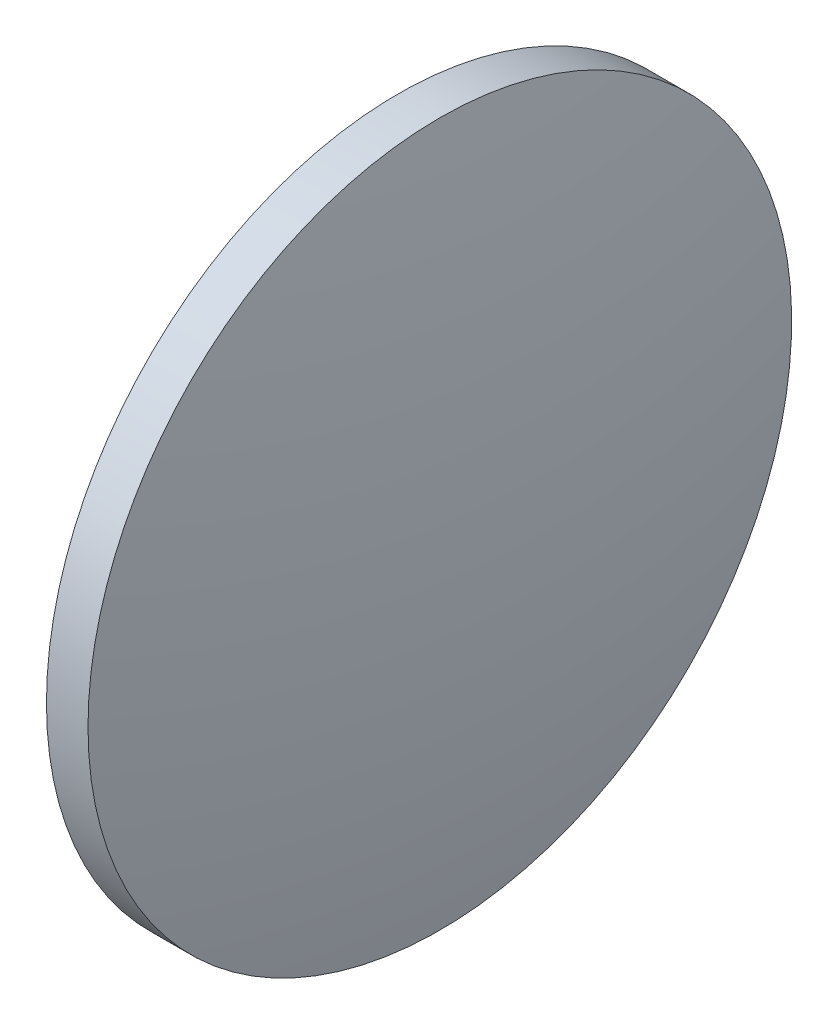
ISO-10303-21;
HEADER;
FILE_DESCRIPTION(('STEP AP214'),'2;1');
FILE_NAME('part.step','',(''),(''),'','','');
FILE_SCHEMA(('AUTOMOTIVE_DESIGN { 1 0 10303 214 1 1 1 1 }'));
ENDSEC;
DATA;
#1=APPLICATION_CONTEXT('core data for automotive mechanical design processes');
#2=APPLICATION_PROTOCOL_DEFINITION('international standard','automotive_design',2000,#1);
#3=PRODUCT_CONTEXT('',#1,'mechanical');
#4=PRODUCT('Part','Part','',(#3));
#5=PRODUCT_RELATED_PRODUCT_CATEGORY('part','',(#4));
#6=PRODUCT_DEFINITION_FORMATION('','',#4);
#7=PRODUCT_DEFINITION_CONTEXT('part definition',#1,'design');
#8=PRODUCT_DEFINITION('design','',#6,#7);
#9=PRODUCT_DEFINITION_SHAPE('','',#8);
#10=(LENGTH_UNIT() NAMED_UNIT(*) SI_UNIT(.MILLI.,.METRE.));
#11=(NAMED_UNIT(*) PLANE_ANGLE_UNIT() SI_UNIT($,.RADIAN.));
#12=(NAMED_UNIT(*) SI_UNIT($,.STERADIAN.) SOLID_ANGLE_UNIT());
#13=UNCERTAINTY_MEASURE_WITH_UNIT(LENGTH_MEASURE(1.E-05),#10,'distance_accuracy_value','');
#14=(GEOMETRIC_REPRESENTATION_CONTEXT(3) GLOBAL_UNCERTAINTY_ASSIGNED_CONTEXT((#13)) GLOBAL_UNIT_ASSIGNED_CONTEXT((#10,
#11,#12)) REPRESENTATION_CONTEXT('',''));
#15=CARTESIAN_POINT('',(0.,0.,0.));
#16=DIRECTION('',(0.,0.,1.));
#17=DIRECTION('',(1.,0.,0.));
#18=AXIS2_PLACEMENT_3D('',#15,#16,#17);
#19=CARTESIAN_POINT('',(101.812486745909,130.467109852824,0.));
#20=DIRECTION('',(-1.,0.,0.));
#21=DIRECTION('',(0.,1.,0.));
#22=AXIS2_PLACEMENT_3D('',#19,#20,#21);
#23=SPHERICAL_SURFACE('',#22,135.608333333333);
#24=CARTESIAN_POINT('',(235.020820079242,130.467109852824,0.));
#25=DIRECTION('',(-1.,0.,0.));
#26=DIRECTION('',(0.,0.,1.));
#27=AXIS2_PLACEMENT_3D('',#24,#25,#26);
#28=CIRCLE('',#27,25.4);
#29=CARTESIAN_POINT('',(235.020820079242,130.467109852824,25.4));
#30=VERTEX_POINT('',#29);
#31=EDGE_CURVE('E10',#30,#30,#28,.T.);
#32=ORIENTED_EDGE('',*,*,#31,.F.);
#33=EDGE_LOOP('',(#32));
#34=FACE_BOUND('',#33,.T.);
#35=ADVANCED_FACE('F35',(#34),#23,.T.);
#36=CARTESIAN_POINT('',(220.330746456977,130.467109852824,0.));
#37=DIRECTION('',(-1.,0.,0.));
#38=DIRECTION('',(0.,0.,1.));
#39=AXIS2_PLACEMENT_3D('',#36,#37,#38);
#40=CYLINDRICAL_SURFACE('',#39,25.4);
#41=CARTESIAN_POINT('',(232.020820079242,130.467109852824,0.));
#42=DIRECTION('',(-1.,0.,0.));
#43=DIRECTION('',(0.,0.,1.));
#44=AXIS2_PLACEMENT_3D('',#41,#42,#43);
#45=CIRCLE('',#44,25.4);
#46=CARTESIAN_POINT('',(232.020820079242,130.467109852824,25.4));
#47=VERTEX_POINT('',#46);
#48=EDGE_CURVE('E41',#47,#47,#45,.T.);
#49=ORIENTED_EDGE('',*,*,#48,.F.);
#50=EDGE_LOOP('',(#49));
#51=FACE_BOUND('',#50,.T.);
#52=ORIENTED_EDGE('',*,*,#31,.T.);
#53=EDGE_LOOP('',(#52));
#54=FACE_BOUND('',#53,.T.);
#55=ADVANCED_FACE('F49',(#51,#54),#40,.T.);
#56=CARTESIAN_POINT('',(232.020820079242,130.467109852824,0.));
#57=DIRECTION('',(1.,0.,0.));
#58=DIRECTION('',(0.,0.,-1.));
#59=AXIS2_PLACEMENT_3D('',#56,#57,#58);
#60=PLANE('',#59);
#61=ORIENTED_EDGE('',*,*,#48,.T.);
#62=EDGE_LOOP('',(#61));
#63=FACE_BOUND('',#62,.T.);
#64=ADVANCED_FACE('F47',(#63),#60,.F.);
#65=CLOSED_SHELL('',(#35,#55,#64));
#66=MANIFOLD_SOLID_BREP('B2',#65);
#67=ADVANCED_BREP_SHAPE_REPRESENTATION('',(#18,#66),#14);
#68=SHAPE_DEFINITION_REPRESENTATION(#9,#67);
ENDSEC;
END-ISO-10303-21;
